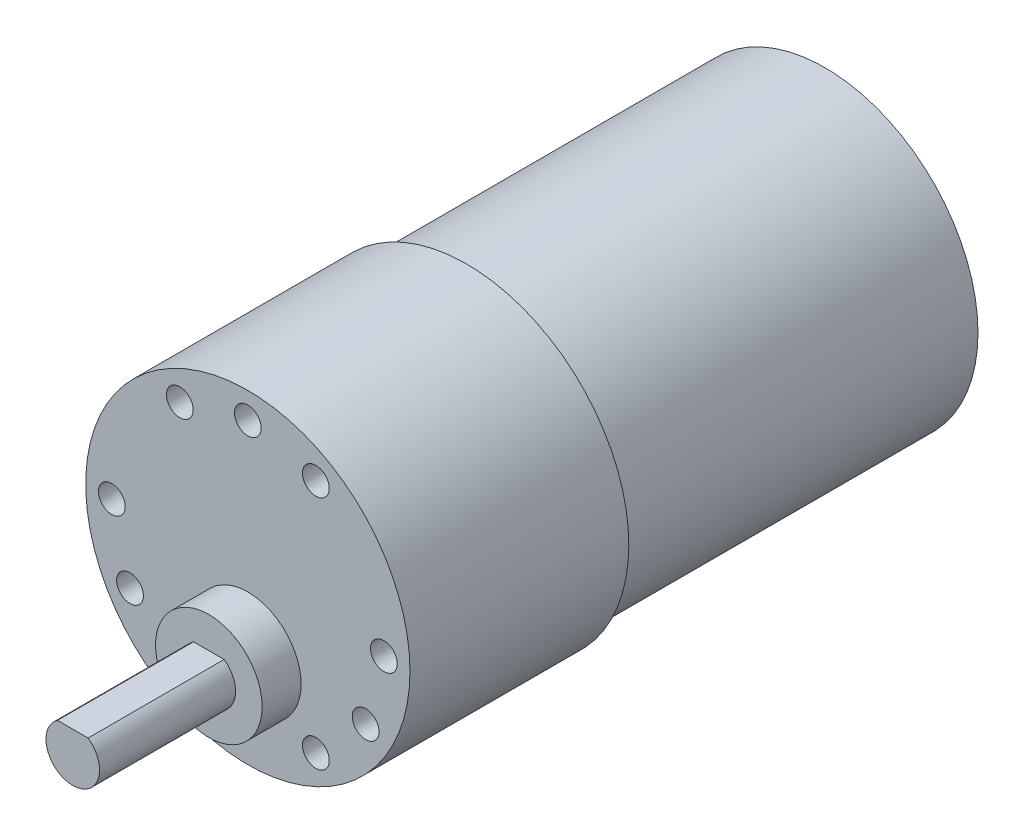
ISO-10303-21;
HEADER;
FILE_DESCRIPTION(('STEP AP214'),'2;1');
FILE_NAME('part.step','',(''),(''),'','','');
FILE_SCHEMA(('AUTOMOTIVE_DESIGN { 1 0 10303 214 1 1 1 1 }'));
ENDSEC;
DATA;
#1=APPLICATION_CONTEXT('core data for automotive mechanical design processes');
#2=APPLICATION_PROTOCOL_DEFINITION('international standard','automotive_design',2000,#1);
#3=PRODUCT_CONTEXT('',#1,'mechanical');
#4=PRODUCT('Part','Part','',(#3));
#5=PRODUCT_RELATED_PRODUCT_CATEGORY('part','',(#4));
#6=PRODUCT_DEFINITION_FORMATION('','',#4);
#7=PRODUCT_DEFINITION_CONTEXT('part definition',#1,'design');
#8=PRODUCT_DEFINITION('design','',#6,#7);
#9=PRODUCT_DEFINITION_SHAPE('','',#8);
#10=(LENGTH_UNIT() NAMED_UNIT(*) SI_UNIT(.MILLI.,.METRE.));
#11=(NAMED_UNIT(*) PLANE_ANGLE_UNIT() SI_UNIT($,.RADIAN.));
#12=(NAMED_UNIT(*) SI_UNIT($,.STERADIAN.) SOLID_ANGLE_UNIT());
#13=UNCERTAINTY_MEASURE_WITH_UNIT(LENGTH_MEASURE(1.E-05),#10,'distance_accuracy_value','');
#14=(GEOMETRIC_REPRESENTATION_CONTEXT(3) GLOBAL_UNCERTAINTY_ASSIGNED_CONTEXT((#13)) GLOBAL_UNIT_ASSIGNED_CONTEXT((#10,
#11,#12)) REPRESENTATION_CONTEXT('',''));
#15=CARTESIAN_POINT('',(0.,0.,0.));
#16=DIRECTION('',(0.,0.,1.));
#17=DIRECTION('',(1.,0.,0.));
#18=AXIS2_PLACEMENT_3D('',#15,#16,#17);
#19=CARTESIAN_POINT('',(0.,0.,-39.116));
#20=DIRECTION('',(0.,0.,-1.));
#21=DIRECTION('',(-1.,0.,0.));
#22=AXIS2_PLACEMENT_3D('',#19,#20,#21);
#23=PLANE('',#22);
#24=DIRECTION('',(0.642787609686543,-0.766044443118975,0.));
#25=VECTOR('',#24,1.);
#26=CARTESIAN_POINT('',(7.15248709016497,-8.91915603771026,-39.116));
#27=LINE('',#26,#25);
#28=CARTESIAN_POINT('',(5.51980656156115,-6.97340315218807,-39.116));
#29=VERTEX_POINT('',#28);
#30=CARTESIAN_POINT('',(7.15248709016497,-8.91915603771026,-39.116));
#31=VERTEX_POINT('',#30);
#32=EDGE_CURVE('E63',#29,#31,#27,.T.);
#33=ORIENTED_EDGE('',*,*,#32,.T.);
#34=DIRECTION('',(-0.766044443118975,-0.642787609686543,0.));
#35=VECTOR('',#34,1.);
#36=CARTESIAN_POINT('',(7.54163766726941,-8.5926199319895,-39.116));
#37=LINE('',#36,#35);
#38=CARTESIAN_POINT('',(7.54163766726941,-8.5926199319895,-39.116));
#39=VERTEX_POINT('',#38);
#40=EDGE_CURVE('E204',#39,#31,#37,.T.);
#41=ORIENTED_EDGE('',*,*,#40,.F.);
#42=DIRECTION('',(0.642787609686543,-0.766044443118975,0.));
#43=VECTOR('',#42,1.);
#44=CARTESIAN_POINT('',(7.54163766726941,-8.5926199319895,-39.116));
#45=LINE('',#44,#43);
#46=CARTESIAN_POINT('',(5.90895713866559,-6.6468670464673,-39.116));
#47=VERTEX_POINT('',#46);
#48=EDGE_CURVE('E179',#47,#39,#45,.T.);
#49=ORIENTED_EDGE('',*,*,#48,.F.);
#50=DIRECTION('',(-0.766044443118975,-0.642787609686543,0.));
#51=VECTOR('',#50,1.);
#52=CARTESIAN_POINT('',(5.90895713866559,-6.6468670464673,-39.116));
#53=LINE('',#52,#51);
#54=EDGE_CURVE('E189',#47,#29,#53,.T.);
#55=ORIENTED_EDGE('',*,*,#54,.T.);
#56=EDGE_LOOP('',(#33,#41,#49,#55));
#57=FACE_BOUND('',#56,.T.);
#58=CARTESIAN_POINT('',(0.,0.,-39.116));
#59=DIRECTION('',(0.,0.,-1.));
#60=DIRECTION('',(-1.,0.,0.));
#61=AXIS2_PLACEMENT_3D('',#58,#59,#60);
#62=CIRCLE('',#61,16.637);
#63=CARTESIAN_POINT('',(-16.637,0.,-39.116));
#64=VERTEX_POINT('',#63);
#65=EDGE_CURVE('E12',#64,#64,#62,.T.);
#66=ORIENTED_EDGE('',*,*,#65,.T.);
#67=EDGE_LOOP('',(#66));
#68=FACE_BOUND('',#67,.T.);
#69=DIRECTION('',(-0.258819045102518,-0.965925826289069,0.));
#70=VECTOR('',#69,1.);
#71=CARTESIAN_POINT('',(-2.87494665811901,-9.7480663576409,-39.116));
#72=LINE('',#71,#70);
#73=CARTESIAN_POINT('',(-2.87494665811901,-9.7480663576409,-39.116));
#74=VERTEX_POINT('',#73);
#75=CARTESIAN_POINT('',(-3.5323470326794,-12.2015179564151,-39.116));
#76=VERTEX_POINT('',#75);
#77=EDGE_CURVE('E55',#74,#76,#72,.T.);
#78=ORIENTED_EDGE('',*,*,#77,.T.);
#79=DIRECTION('',(-0.965925826289069,0.258819045102518,0.));
#80=VECTOR('',#79,1.);
#81=CARTESIAN_POINT('',(-3.04165671292456,-12.3329980313272,-39.116));
#82=LINE('',#81,#80);
#83=CARTESIAN_POINT('',(-3.04165671292456,-12.3329980313272,-39.116));
#84=VERTEX_POINT('',#83);
#85=EDGE_CURVE('E150',#84,#76,#82,.T.);
#86=ORIENTED_EDGE('',*,*,#85,.F.);
#87=DIRECTION('',(-0.258819045102518,-0.965925826289069,0.));
#88=VECTOR('',#87,1.);
#89=CARTESIAN_POINT('',(-2.38425633836416,-9.87954643255298,-39.116));
#90=LINE('',#89,#88);
#91=CARTESIAN_POINT('',(-2.38425633836416,-9.87954643255298,-39.116));
#92=VERTEX_POINT('',#91);
#93=EDGE_CURVE('E156',#92,#84,#90,.T.);
#94=ORIENTED_EDGE('',*,*,#93,.F.);
#95=DIRECTION('',(-0.965925826289069,0.258819045102518,0.));
#96=VECTOR('',#95,1.);
#97=CARTESIAN_POINT('',(-2.38425633836416,-9.87954643255298,-39.116));
#98=LINE('',#97,#96);
#99=EDGE_CURVE('E521',#92,#74,#98,.T.);
#100=ORIENTED_EDGE('',*,*,#99,.T.);
#101=EDGE_LOOP('',(#78,#86,#94,#100));
#102=FACE_BOUND('',#101,.T.);
#103=ADVANCED_FACE('F41',(#57,#68,#102),#23,.T.);
#104=CARTESIAN_POINT('',(0.,0.,-40.132));
#105=DIRECTION('',(0.,0.,-1.));
#106=DIRECTION('',(-1.,0.,0.));
#107=AXIS2_PLACEMENT_3D('',#104,#105,#106);
#108=PLANE('',#107);
#109=CARTESIAN_POINT('',(0.,0.,-40.132));
#110=DIRECTION('',(0.,0.,-1.));
#111=DIRECTION('',(-1.,0.,0.));
#112=AXIS2_PLACEMENT_3D('',#109,#110,#111);
#113=CIRCLE('',#112,16.637);
#114=CARTESIAN_POINT('',(-16.637,0.,-40.132));
#115=VERTEX_POINT('',#114);
#116=EDGE_CURVE('E48',#115,#115,#113,.T.);
#117=ORIENTED_EDGE('',*,*,#116,.F.);
#118=EDGE_LOOP('',(#117));
#119=FACE_BOUND('',#118,.T.);
#120=CARTESIAN_POINT('',(0.,0.,-40.132));
#121=DIRECTION('',(0.,0.,-1.));
#122=DIRECTION('',(-1.,0.,0.));
#123=AXIS2_PLACEMENT_3D('',#120,#121,#122);
#124=CIRCLE('',#123,17.145);
#125=CARTESIAN_POINT('',(-17.145,0.,-40.132));
#126=VERTEX_POINT('',#125);
#127=EDGE_CURVE('E207',#126,#126,#124,.T.);
#128=ORIENTED_EDGE('',*,*,#127,.T.);
#129=EDGE_LOOP('',(#128));
#130=FACE_BOUND('',#129,.T.);
#131=ADVANCED_FACE('F298',(#119,#130),#108,.T.);
#132=CARTESIAN_POINT('',(0.,0.,0.));
#133=DIRECTION('',(0.,0.,1.));
#134=DIRECTION('',(1.,0.,0.));
#135=AXIS2_PLACEMENT_3D('',#132,#133,#134);
#136=PLANE('',#135);
#137=CARTESIAN_POINT('',(0.,0.,0.));
#138=DIRECTION('',(0.,0.,1.));
#139=DIRECTION('',(1.,0.,0.));
#140=AXIS2_PLACEMENT_3D('',#137,#138,#139);
#141=CIRCLE('',#140,18.161);
#142=CARTESIAN_POINT('',(18.161,0.,0.));
#143=VERTEX_POINT('',#142);
#144=EDGE_CURVE('E212',#143,#143,#141,.T.);
#145=ORIENTED_EDGE('',*,*,#144,.F.);
#146=EDGE_LOOP('',(#145));
#147=FACE_BOUND('',#146,.T.);
#148=CARTESIAN_POINT('',(0.,0.,0.));
#149=DIRECTION('',(0.,0.,1.));
#150=DIRECTION('',(1.,0.,0.));
#151=AXIS2_PLACEMENT_3D('',#148,#149,#150);
#152=CIRCLE('',#151,17.145);
#153=CARTESIAN_POINT('',(17.145,0.,0.));
#154=VERTEX_POINT('',#153);
#155=EDGE_CURVE('E208',#154,#154,#152,.F.);
#156=ORIENTED_EDGE('',*,*,#155,.F.);
#157=EDGE_LOOP('',(#156));
#158=FACE_BOUND('',#157,.T.);
#159=ADVANCED_FACE('F301',(#147,#158),#136,.F.);
#160=CARTESIAN_POINT('',(0.,-7.366,28.8798));
#161=DIRECTION('',(0.,0.,1.));
#162=DIRECTION('',(1.,0.,0.));
#163=AXIS2_PLACEMENT_3D('',#160,#161,#162);
#164=PLANE('',#163);
#165=CARTESIAN_POINT('',(0.,-7.366,28.8798));
#166=DIRECTION('',(0.,0.,1.));
#167=DIRECTION('',(1.,0.,0.));
#168=AXIS2_PLACEMENT_3D('',#165,#166,#167);
#169=CIRCLE('',#168,5.969);
#170=CARTESIAN_POINT('',(5.969,-7.366,28.8798));
#171=VERTEX_POINT('',#170);
#172=EDGE_CURVE('E219',#171,#171,#169,.T.);
#173=ORIENTED_EDGE('',*,*,#172,.T.);
#174=EDGE_LOOP('',(#173));
#175=FACE_BOUND('',#174,.T.);
#176=DIRECTION('',(-1.,0.,0.));
#177=VECTOR('',#176,1.);
#178=CARTESIAN_POINT('',(-1.71565701700544,-4.905,28.8798));
#179=LINE('',#178,#177);
#180=CARTESIAN_POINT('',(1.71565701700544,-4.905,28.8798));
#181=VERTEX_POINT('',#180);
#182=CARTESIAN_POINT('',(-1.71565701700544,-4.905,28.8798));
#183=VERTEX_POINT('',#182);
#184=EDGE_CURVE('E229',#181,#183,#179,.T.);
#185=ORIENTED_EDGE('',*,*,#184,.F.);
#186=CARTESIAN_POINT('',(0.,-7.366,28.8798));
#187=DIRECTION('',(0.,0.,1.));
#188=DIRECTION('',(1.,0.,0.));
#189=AXIS2_PLACEMENT_3D('',#186,#187,#188);
#190=CIRCLE('',#189,3.);
#191=EDGE_CURVE('E222',#183,#181,#190,.T.);
#192=ORIENTED_EDGE('',*,*,#191,.F.);
#193=EDGE_LOOP('',(#185,#192));
#194=FACE_BOUND('',#193,.T.);
#195=ADVANCED_FACE('F313',(#175,#194),#164,.T.);
#196=CARTESIAN_POINT('',(0.,0.,24.511));
#197=DIRECTION('',(0.,0.,1.));
#198=DIRECTION('',(1.,0.,0.));
#199=AXIS2_PLACEMENT_3D('',#196,#197,#198);
#200=PLANE('',#199);
#201=CARTESIAN_POINT('',(-7.61999999999983,13.1982271536749,24.511));
#202=DIRECTION('',(0.,0.,1.));
#203=DIRECTION('',(1.,0.,0.));
#204=AXIS2_PLACEMENT_3D('',#201,#202,#203);
#205=CIRCLE('',#204,1.49999999999999);
#206=CARTESIAN_POINT('',(-6.11999999999984,13.1982271536749,24.511));
#207=VERTEX_POINT('',#206);
#208=EDGE_CURVE('E211',#207,#207,#205,.T.);
#209=ORIENTED_EDGE('',*,*,#208,.F.);
#210=EDGE_LOOP('',(#209));
#211=FACE_BOUND('',#210,.T.);
#212=CARTESIAN_POINT('',(-15.24,1.59630526811908E-13,24.511));
#213=DIRECTION('',(0.,0.,1.));
#214=DIRECTION('',(1.,0.,0.));
#215=AXIS2_PLACEMENT_3D('',#212,#213,#214);
#216=CIRCLE('',#215,1.49999999999999);
#217=CARTESIAN_POINT('',(-13.74,1.59630526811908E-13,24.511));
#218=VERTEX_POINT('',#217);
#219=EDGE_CURVE('E284',#218,#218,#216,.T.);
#220=ORIENTED_EDGE('',*,*,#219,.F.);
#221=EDGE_LOOP('',(#220));
#222=FACE_BOUND('',#221,.T.);
#223=CARTESIAN_POINT('',(-13.1982271536749,-7.61999999999988,24.511));
#224=DIRECTION('',(0.,0.,1.));
#225=DIRECTION('',(1.,0.,0.));
#226=AXIS2_PLACEMENT_3D('',#223,#224,#225);
#227=CIRCLE('',#226,1.49999999999999);
#228=CARTESIAN_POINT('',(-11.6982271536749,-7.61999999999988,24.511));
#229=VERTEX_POINT('',#228);
#230=EDGE_CURVE('E278',#229,#229,#227,.T.);
#231=ORIENTED_EDGE('',*,*,#230,.F.);
#232=EDGE_LOOP('',(#231));
#233=FACE_BOUND('',#232,.T.);
#234=CARTESIAN_POINT('',(-7.62000000000011,-13.1982271536748,24.511));
#235=DIRECTION('',(0.,0.,1.));
#236=DIRECTION('',(1.,0.,0.));
#237=AXIS2_PLACEMENT_3D('',#234,#235,#236);
#238=CIRCLE('',#237,1.49999999999999);
#239=CARTESIAN_POINT('',(-6.12000000000012,-13.1982271536748,24.511));
#240=VERTEX_POINT('',#239);
#241=EDGE_CURVE('E272',#240,#240,#238,.T.);
#242=ORIENTED_EDGE('',*,*,#241,.F.);
#243=EDGE_LOOP('',(#242));
#244=FACE_BOUND('',#243,.T.);
#245=CARTESIAN_POINT('',(7.61999999999992,-13.1982271536749,24.511));
#246=DIRECTION('',(0.,0.,1.));
#247=DIRECTION('',(1.,0.,0.));
#248=AXIS2_PLACEMENT_3D('',#245,#246,#247);
#249=CIRCLE('',#248,1.49999999999999);
#250=CARTESIAN_POINT('',(9.11999999999991,-13.1982271536749,24.511));
#251=VERTEX_POINT('',#250);
#252=EDGE_CURVE('E266',#251,#251,#249,.T.);
#253=ORIENTED_EDGE('',*,*,#252,.F.);
#254=EDGE_LOOP('',(#253));
#255=FACE_BOUND('',#254,.T.);
#256=CARTESIAN_POINT('',(13.1982271536748,-7.62000000000006,24.511));
#257=DIRECTION('',(0.,0.,1.));
#258=DIRECTION('',(1.,0.,0.));
#259=AXIS2_PLACEMENT_3D('',#256,#257,#258);
#260=CIRCLE('',#259,1.49999999999999);
#261=CARTESIAN_POINT('',(14.6982271536748,-7.62000000000006,24.511));
#262=VERTEX_POINT('',#261);
#263=EDGE_CURVE('E260',#262,#262,#260,.T.);
#264=ORIENTED_EDGE('',*,*,#263,.F.);
#265=EDGE_LOOP('',(#264));
#266=FACE_BOUND('',#265,.T.);
#267=CARTESIAN_POINT('',(15.24,0.,24.511));
#268=DIRECTION('',(0.,0.,1.));
#269=DIRECTION('',(1.,0.,0.));
#270=AXIS2_PLACEMENT_3D('',#267,#268,#269);
#271=CIRCLE('',#270,1.49999999999999);
#272=CARTESIAN_POINT('',(16.74,0.,24.511));
#273=VERTEX_POINT('',#272);
#274=EDGE_CURVE('E254',#273,#273,#271,.T.);
#275=ORIENTED_EDGE('',*,*,#274,.F.);
#276=EDGE_LOOP('',(#275));
#277=FACE_BOUND('',#276,.T.);
#278=CARTESIAN_POINT('',(7.62000000000002,13.1982271536748,24.511));
#279=DIRECTION('',(0.,0.,1.));
#280=DIRECTION('',(1.,0.,0.));
#281=AXIS2_PLACEMENT_3D('',#278,#279,#280);
#282=CIRCLE('',#281,1.49999999999999);
#283=CARTESIAN_POINT('',(9.12,13.1982271536748,24.511));
#284=VERTEX_POINT('',#283);
#285=EDGE_CURVE('E248',#284,#284,#282,.T.);
#286=ORIENTED_EDGE('',*,*,#285,.F.);
#287=EDGE_LOOP('',(#286));
#288=FACE_BOUND('',#287,.T.);
#289=CARTESIAN_POINT('',(0.,15.24,24.511));
#290=DIRECTION('',(0.,0.,1.));
#291=DIRECTION('',(1.,0.,0.));
#292=AXIS2_PLACEMENT_3D('',#289,#290,#291);
#293=CIRCLE('',#292,1.49999999999999);
#294=CARTESIAN_POINT('',(1.49999999999999,15.24,24.511));
#295=VERTEX_POINT('',#294);
#296=EDGE_CURVE('E242',#295,#295,#293,.T.);
#297=ORIENTED_EDGE('',*,*,#296,.F.);
#298=EDGE_LOOP('',(#297));
#299=FACE_BOUND('',#298,.T.);
#300=CARTESIAN_POINT('',(0.,0.,24.511));
#301=DIRECTION('',(0.,0.,1.));
#302=DIRECTION('',(1.,0.,0.));
#303=AXIS2_PLACEMENT_3D('',#300,#301,#302);
#304=CIRCLE('',#303,18.161);
#305=CARTESIAN_POINT('',(18.161,0.,24.511));
#306=VERTEX_POINT('',#305);
#307=EDGE_CURVE('E216',#306,#306,#304,.T.);
#308=ORIENTED_EDGE('',*,*,#307,.T.);
#309=EDGE_LOOP('',(#308));
#310=FACE_BOUND('',#309,.T.);
#311=CARTESIAN_POINT('',(0.,-7.366,24.511));
#312=DIRECTION('',(0.,0.,1.));
#313=DIRECTION('',(1.,0.,0.));
#314=AXIS2_PLACEMENT_3D('',#311,#312,#313);
#315=CIRCLE('',#314,5.969);
#316=CARTESIAN_POINT('',(5.969,-7.366,24.511));
#317=VERTEX_POINT('',#316);
#318=EDGE_CURVE('E215',#317,#317,#315,.T.);
#319=ORIENTED_EDGE('',*,*,#318,.F.);
#320=EDGE_LOOP('',(#319));
#321=FACE_BOUND('',#320,.T.);
#322=ADVANCED_FACE('F319',(#211,#222,#233,#244,#255,#266,#277,#288,#299,#310,#321),#200,.T.);
#323=CARTESIAN_POINT('',(0.,0.,24.511));
#324=DIRECTION('',(0.,0.,-1.));
#325=DIRECTION('',(-1.,0.,0.));
#326=AXIS2_PLACEMENT_3D('',#323,#324,#325);
#327=CYLINDRICAL_SURFACE('',#326,18.161);
#328=ORIENTED_EDGE('',*,*,#307,.F.);
#329=EDGE_LOOP('',(#328));
#330=FACE_BOUND('',#329,.T.);
#331=ORIENTED_EDGE('',*,*,#144,.T.);
#332=EDGE_LOOP('',(#331));
#333=FACE_BOUND('',#332,.T.);
#334=ADVANCED_FACE('F427',(#330,#333),#327,.T.);
#335=CARTESIAN_POINT('',(0.,-7.366,28.8798));
#336=DIRECTION('',(0.,0.,-1.));
#337=DIRECTION('',(-1.,0.,0.));
#338=AXIS2_PLACEMENT_3D('',#335,#336,#337);
#339=CYLINDRICAL_SURFACE('',#338,5.969);
#340=ORIENTED_EDGE('',*,*,#172,.F.);
#341=EDGE_LOOP('',(#340));
#342=FACE_BOUND('',#341,.T.);
#343=ORIENTED_EDGE('',*,*,#318,.T.);
#344=EDGE_LOOP('',(#343));
#345=FACE_BOUND('',#344,.T.);
#346=ADVANCED_FACE('F423',(#342,#345),#339,.T.);
#347=CARTESIAN_POINT('',(0.,-7.366,44.1198));
#348=DIRECTION('',(0.,0.,-1.));
#349=DIRECTION('',(-1.,0.,0.));
#350=AXIS2_PLACEMENT_3D('',#347,#348,#349);
#351=CYLINDRICAL_SURFACE('',#350,3.);
#352=ORIENTED_EDGE('',*,*,#191,.T.);
#353=DIRECTION('',(0.,0.,-1.));
#354=VECTOR('',#353,1.);
#355=CARTESIAN_POINT('',(1.71565701700544,-4.905,44.1198));
#356=LINE('',#355,#354);
#357=CARTESIAN_POINT('',(1.71565701700544,-4.905,44.1198));
#358=VERTEX_POINT('',#357);
#359=EDGE_CURVE('E225',#358,#181,#356,.T.);
#360=ORIENTED_EDGE('',*,*,#359,.F.);
#361=CARTESIAN_POINT('',(0.,-7.366,44.1198));
#362=DIRECTION('',(0.,0.,1.));
#363=DIRECTION('',(1.,0.,0.));
#364=AXIS2_PLACEMENT_3D('',#361,#362,#363);
#365=CIRCLE('',#364,3.);
#366=CARTESIAN_POINT('',(-1.71565701700544,-4.905,44.1198));
#367=VERTEX_POINT('',#366);
#368=EDGE_CURVE('E228',#367,#358,#365,.T.);
#369=ORIENTED_EDGE('',*,*,#368,.F.);
#370=DIRECTION('',(0.,0.,-1.));
#371=VECTOR('',#370,1.);
#372=CARTESIAN_POINT('',(-1.71565701700544,-4.905,44.1198));
#373=LINE('',#372,#371);
#374=EDGE_CURVE('E230',#367,#183,#373,.T.);
#375=ORIENTED_EDGE('',*,*,#374,.T.);
#376=EDGE_LOOP('',(#352,#360,#369,#375));
#377=FACE_BOUND('',#376,.T.);
#378=ADVANCED_FACE('F420',(#377),#351,.T.);
#379=CARTESIAN_POINT('',(-1.71565701700544,-4.905,44.1198));
#380=DIRECTION('',(0.,-1.,0.));
#381=DIRECTION('',(0.,0.,-1.));
#382=AXIS2_PLACEMENT_3D('',#379,#380,#381);
#383=PLANE('',#382);
#384=ORIENTED_EDGE('',*,*,#184,.T.);
#385=ORIENTED_EDGE('',*,*,#374,.F.);
#386=DIRECTION('',(-1.,0.,0.));
#387=VECTOR('',#386,1.);
#388=CARTESIAN_POINT('',(-1.71565701700544,-4.905,44.1198));
#389=LINE('',#388,#387);
#390=EDGE_CURVE('E235',#358,#367,#389,.T.);
#391=ORIENTED_EDGE('',*,*,#390,.F.);
#392=ORIENTED_EDGE('',*,*,#359,.T.);
#393=EDGE_LOOP('',(#384,#385,#391,#392));
#394=FACE_BOUND('',#393,.T.);
#395=ADVANCED_FACE('F416',(#394),#383,.F.);
#396=CARTESIAN_POINT('',(0.,-7.366,44.1198));
#397=DIRECTION('',(0.,0.,1.));
#398=DIRECTION('',(1.,0.,0.));
#399=AXIS2_PLACEMENT_3D('',#396,#397,#398);
#400=PLANE('',#399);
#401=ORIENTED_EDGE('',*,*,#368,.T.);
#402=ORIENTED_EDGE('',*,*,#390,.T.);
#403=EDGE_LOOP('',(#401,#402));
#404=FACE_BOUND('',#403,.T.);
#405=ADVANCED_FACE('F412',(#404),#400,.T.);
#406=CARTESIAN_POINT('',(0.,15.24,14.351));
#407=DIRECTION('',(0.,0.,1.));
#408=DIRECTION('',(1.,0.,0.));
#409=AXIS2_PLACEMENT_3D('',#406,#407,#408);
#410=CONICAL_SURFACE('',#409,1.49999999999999,1.02974425867665);
#411=CARTESIAN_POINT('',(0.,15.24,13.4497090714587));
#412=VERTEX_POINT('',#411);
#413=VERTEX_LOOP('',#412);
#414=FACE_BOUND('',#413,.T.);
#415=CARTESIAN_POINT('',(0.,15.24,14.351));
#416=DIRECTION('',(0.,0.,1.));
#417=DIRECTION('',(1.,0.,0.));
#418=AXIS2_PLACEMENT_3D('',#415,#416,#417);
#419=CIRCLE('',#418,1.49999999999999);
#420=CARTESIAN_POINT('',(1.49999999999999,15.24,14.351));
#421=VERTEX_POINT('',#420);
#422=EDGE_CURVE('E237',#421,#421,#419,.T.);
#423=ORIENTED_EDGE('',*,*,#422,.T.);
#424=EDGE_LOOP('',(#423));
#425=FACE_BOUND('',#424,.T.);
#426=ADVANCED_FACE('F408',(#414,#425),#410,.F.);
#427=CARTESIAN_POINT('',(0.,15.24,24.511));
#428=DIRECTION('',(0.,0.,1.));
#429=DIRECTION('',(1.,0.,0.));
#430=AXIS2_PLACEMENT_3D('',#427,#428,#429);
#431=CYLINDRICAL_SURFACE('',#430,1.49999999999999);
#432=ORIENTED_EDGE('',*,*,#422,.F.);
#433=EDGE_LOOP('',(#432));
#434=FACE_BOUND('',#433,.T.);
#435=ORIENTED_EDGE('',*,*,#296,.T.);
#436=EDGE_LOOP('',(#435));
#437=FACE_BOUND('',#436,.T.);
#438=ADVANCED_FACE('F404',(#434,#437),#431,.F.);
#439=CARTESIAN_POINT('',(7.62000000000002,13.1982271536748,14.351));
#440=DIRECTION('',(0.,0.,1.));
#441=DIRECTION('',(1.,0.,0.));
#442=AXIS2_PLACEMENT_3D('',#439,#440,#441);
#443=CONICAL_SURFACE('',#442,1.49999999999999,1.02974425867665);
#444=CARTESIAN_POINT('',(7.62000000000001,13.1982271536748,13.4497090714587));
#445=VERTEX_POINT('',#444);
#446=VERTEX_LOOP('',#445);
#447=FACE_BOUND('',#446,.T.);
#448=CARTESIAN_POINT('',(7.62000000000002,13.1982271536748,14.351));
#449=DIRECTION('',(0.,0.,1.));
#450=DIRECTION('',(1.,0.,0.));
#451=AXIS2_PLACEMENT_3D('',#448,#449,#450);
#452=CIRCLE('',#451,1.49999999999999);
#453=CARTESIAN_POINT('',(9.12,13.1982271536748,14.351));
#454=VERTEX_POINT('',#453);
#455=EDGE_CURVE('E245',#454,#454,#452,.T.);
#456=ORIENTED_EDGE('',*,*,#455,.T.);
#457=EDGE_LOOP('',(#456));
#458=FACE_BOUND('',#457,.T.);
#459=ADVANCED_FACE('F400',(#447,#458),#443,.F.);
#460=CARTESIAN_POINT('',(7.62000000000002,13.1982271536748,24.511));
#461=DIRECTION('',(0.,0.,1.));
#462=DIRECTION('',(1.,0.,0.));
#463=AXIS2_PLACEMENT_3D('',#460,#461,#462);
#464=CYLINDRICAL_SURFACE('',#463,1.49999999999999);
#465=ORIENTED_EDGE('',*,*,#455,.F.);
#466=EDGE_LOOP('',(#465));
#467=FACE_BOUND('',#466,.T.);
#468=ORIENTED_EDGE('',*,*,#285,.T.);
#469=EDGE_LOOP('',(#468));
#470=FACE_BOUND('',#469,.T.);
#471=ADVANCED_FACE('F396',(#467,#470),#464,.F.);
#472=CARTESIAN_POINT('',(15.24,0.,14.351));
#473=DIRECTION('',(0.,0.,1.));
#474=DIRECTION('',(1.,0.,0.));
#475=AXIS2_PLACEMENT_3D('',#472,#473,#474);
#476=CONICAL_SURFACE('',#475,1.49999999999999,1.02974425867665);
#477=CARTESIAN_POINT('',(15.24,0.,13.4497090714587));
#478=VERTEX_POINT('',#477);
#479=VERTEX_LOOP('',#478);
#480=FACE_BOUND('',#479,.T.);
#481=CARTESIAN_POINT('',(15.24,0.,14.351));
#482=DIRECTION('',(0.,0.,1.));
#483=DIRECTION('',(1.,0.,0.));
#484=AXIS2_PLACEMENT_3D('',#481,#482,#483);
#485=CIRCLE('',#484,1.49999999999999);
#486=CARTESIAN_POINT('',(16.74,0.,14.351));
#487=VERTEX_POINT('',#486);
#488=EDGE_CURVE('E251',#487,#487,#485,.T.);
#489=ORIENTED_EDGE('',*,*,#488,.T.);
#490=EDGE_LOOP('',(#489));
#491=FACE_BOUND('',#490,.T.);
#492=ADVANCED_FACE('F392',(#480,#491),#476,.F.);
#493=CARTESIAN_POINT('',(15.24,0.,24.511));
#494=DIRECTION('',(0.,0.,1.));
#495=DIRECTION('',(1.,0.,0.));
#496=AXIS2_PLACEMENT_3D('',#493,#494,#495);
#497=CYLINDRICAL_SURFACE('',#496,1.49999999999999);
#498=ORIENTED_EDGE('',*,*,#488,.F.);
#499=EDGE_LOOP('',(#498));
#500=FACE_BOUND('',#499,.T.);
#501=ORIENTED_EDGE('',*,*,#274,.T.);
#502=EDGE_LOOP('',(#501));
#503=FACE_BOUND('',#502,.T.);
#504=ADVANCED_FACE('F388',(#500,#503),#497,.F.);
#505=CARTESIAN_POINT('',(13.1982271536748,-7.62000000000006,14.351));
#506=DIRECTION('',(0.,0.,1.));
#507=DIRECTION('',(1.,0.,0.));
#508=AXIS2_PLACEMENT_3D('',#505,#506,#507);
#509=CONICAL_SURFACE('',#508,1.49999999999999,1.02974425867665);
#510=CARTESIAN_POINT('',(13.1982271536748,-7.62000000000006,13.4497090714587));
#511=VERTEX_POINT('',#510);
#512=VERTEX_LOOP('',#511);
#513=FACE_BOUND('',#512,.T.);
#514=CARTESIAN_POINT('',(13.1982271536748,-7.62000000000006,14.351));
#515=DIRECTION('',(0.,0.,1.));
#516=DIRECTION('',(1.,0.,0.));
#517=AXIS2_PLACEMENT_3D('',#514,#515,#516);
#518=CIRCLE('',#517,1.49999999999999);
#519=CARTESIAN_POINT('',(14.6982271536748,-7.62000000000006,14.351));
#520=VERTEX_POINT('',#519);
#521=EDGE_CURVE('E257',#520,#520,#518,.T.);
#522=ORIENTED_EDGE('',*,*,#521,.T.);
#523=EDGE_LOOP('',(#522));
#524=FACE_BOUND('',#523,.T.);
#525=ADVANCED_FACE('F384',(#513,#524),#509,.F.);
#526=CARTESIAN_POINT('',(13.1982271536748,-7.62000000000006,24.511));
#527=DIRECTION('',(0.,0.,1.));
#528=DIRECTION('',(1.,0.,0.));
#529=AXIS2_PLACEMENT_3D('',#526,#527,#528);
#530=CYLINDRICAL_SURFACE('',#529,1.49999999999999);
#531=ORIENTED_EDGE('',*,*,#521,.F.);
#532=EDGE_LOOP('',(#531));
#533=FACE_BOUND('',#532,.T.);
#534=ORIENTED_EDGE('',*,*,#263,.T.);
#535=EDGE_LOOP('',(#534));
#536=FACE_BOUND('',#535,.T.);
#537=ADVANCED_FACE('F380',(#533,#536),#530,.F.);
#538=CARTESIAN_POINT('',(7.61999999999992,-13.1982271536749,14.351));
#539=DIRECTION('',(0.,0.,1.));
#540=DIRECTION('',(1.,0.,0.));
#541=AXIS2_PLACEMENT_3D('',#538,#539,#540);
#542=CONICAL_SURFACE('',#541,1.49999999999999,1.02974425867665);
#543=CARTESIAN_POINT('',(7.61999999999992,-13.1982271536749,13.4497090714587));
#544=VERTEX_POINT('',#543);
#545=VERTEX_LOOP('',#544);
#546=FACE_BOUND('',#545,.T.);
#547=CARTESIAN_POINT('',(7.61999999999992,-13.1982271536749,14.351));
#548=DIRECTION('',(0.,0.,1.));
#549=DIRECTION('',(1.,0.,0.));
#550=AXIS2_PLACEMENT_3D('',#547,#548,#549);
#551=CIRCLE('',#550,1.49999999999999);
#552=CARTESIAN_POINT('',(9.11999999999991,-13.1982271536749,14.351));
#553=VERTEX_POINT('',#552);
#554=EDGE_CURVE('E263',#553,#553,#551,.T.);
#555=ORIENTED_EDGE('',*,*,#554,.T.);
#556=EDGE_LOOP('',(#555));
#557=FACE_BOUND('',#556,.T.);
#558=ADVANCED_FACE('F376',(#546,#557),#542,.F.);
#559=CARTESIAN_POINT('',(7.61999999999992,-13.1982271536749,24.511));
#560=DIRECTION('',(0.,0.,1.));
#561=DIRECTION('',(1.,0.,0.));
#562=AXIS2_PLACEMENT_3D('',#559,#560,#561);
#563=CYLINDRICAL_SURFACE('',#562,1.49999999999999);
#564=ORIENTED_EDGE('',*,*,#554,.F.);
#565=EDGE_LOOP('',(#564));
#566=FACE_BOUND('',#565,.T.);
#567=ORIENTED_EDGE('',*,*,#252,.T.);
#568=EDGE_LOOP('',(#567));
#569=FACE_BOUND('',#568,.T.);
#570=ADVANCED_FACE('F372',(#566,#569),#563,.F.);
#571=CARTESIAN_POINT('',(-7.62000000000011,-13.1982271536748,14.351));
#572=DIRECTION('',(0.,0.,1.));
#573=DIRECTION('',(1.,0.,0.));
#574=AXIS2_PLACEMENT_3D('',#571,#572,#573);
#575=CONICAL_SURFACE('',#574,1.49999999999999,1.02974425867665);
#576=CARTESIAN_POINT('',(-7.62000000000011,-13.1982271536748,13.4497090714587));
#577=VERTEX_POINT('',#576);
#578=VERTEX_LOOP('',#577);
#579=FACE_BOUND('',#578,.T.);
#580=CARTESIAN_POINT('',(-7.62000000000011,-13.1982271536748,14.351));
#581=DIRECTION('',(0.,0.,1.));
#582=DIRECTION('',(1.,0.,0.));
#583=AXIS2_PLACEMENT_3D('',#580,#581,#582);
#584=CIRCLE('',#583,1.49999999999999);
#585=CARTESIAN_POINT('',(-6.12000000000012,-13.1982271536748,14.351));
#586=VERTEX_POINT('',#585);
#587=EDGE_CURVE('E269',#586,#586,#584,.T.);
#588=ORIENTED_EDGE('',*,*,#587,.T.);
#589=EDGE_LOOP('',(#588));
#590=FACE_BOUND('',#589,.T.);
#591=ADVANCED_FACE('F368',(#579,#590),#575,.F.);
#592=CARTESIAN_POINT('',(-7.62000000000011,-13.1982271536748,24.511));
#593=DIRECTION('',(0.,0.,1.));
#594=DIRECTION('',(1.,0.,0.));
#595=AXIS2_PLACEMENT_3D('',#592,#593,#594);
#596=CYLINDRICAL_SURFACE('',#595,1.49999999999999);
#597=ORIENTED_EDGE('',*,*,#587,.F.);
#598=EDGE_LOOP('',(#597));
#599=FACE_BOUND('',#598,.T.);
#600=ORIENTED_EDGE('',*,*,#241,.T.);
#601=EDGE_LOOP('',(#600));
#602=FACE_BOUND('',#601,.T.);
#603=ADVANCED_FACE('F364',(#599,#602),#596,.F.);
#604=CARTESIAN_POINT('',(-13.1982271536749,-7.61999999999988,14.351));
#605=DIRECTION('',(0.,0.,1.));
#606=DIRECTION('',(1.,0.,0.));
#607=AXIS2_PLACEMENT_3D('',#604,#605,#606);
#608=CONICAL_SURFACE('',#607,1.49999999999999,1.02974425867665);
#609=CARTESIAN_POINT('',(-13.1982271536749,-7.61999999999988,13.4497090714587));
#610=VERTEX_POINT('',#609);
#611=VERTEX_LOOP('',#610);
#612=FACE_BOUND('',#611,.T.);
#613=CARTESIAN_POINT('',(-13.1982271536749,-7.61999999999988,14.351));
#614=DIRECTION('',(0.,0.,1.));
#615=DIRECTION('',(1.,0.,0.));
#616=AXIS2_PLACEMENT_3D('',#613,#614,#615);
#617=CIRCLE('',#616,1.49999999999999);
#618=CARTESIAN_POINT('',(-11.6982271536749,-7.61999999999988,14.351));
#619=VERTEX_POINT('',#618);
#620=EDGE_CURVE('E275',#619,#619,#617,.T.);
#621=ORIENTED_EDGE('',*,*,#620,.T.);
#622=EDGE_LOOP('',(#621));
#623=FACE_BOUND('',#622,.T.);
#624=ADVANCED_FACE('F360',(#612,#623),#608,.F.);
#625=CARTESIAN_POINT('',(-13.1982271536749,-7.61999999999988,24.511));
#626=DIRECTION('',(0.,0.,1.));
#627=DIRECTION('',(1.,0.,0.));
#628=AXIS2_PLACEMENT_3D('',#625,#626,#627);
#629=CYLINDRICAL_SURFACE('',#628,1.49999999999999);
#630=ORIENTED_EDGE('',*,*,#620,.F.);
#631=EDGE_LOOP('',(#630));
#632=FACE_BOUND('',#631,.T.);
#633=ORIENTED_EDGE('',*,*,#230,.T.);
#634=EDGE_LOOP('',(#633));
#635=FACE_BOUND('',#634,.T.);
#636=ADVANCED_FACE('F356',(#632,#635),#629,.F.);
#637=CARTESIAN_POINT('',(-15.24,1.59630526811908E-13,14.351));
#638=DIRECTION('',(0.,0.,1.));
#639=DIRECTION('',(1.,0.,0.));
#640=AXIS2_PLACEMENT_3D('',#637,#638,#639);
#641=CONICAL_SURFACE('',#640,1.49999999999999,1.02974425867665);
#642=CARTESIAN_POINT('',(-15.24,1.59630526811908E-13,13.4497090714587));
#643=VERTEX_POINT('',#642);
#644=VERTEX_LOOP('',#643);
#645=FACE_BOUND('',#644,.T.);
#646=CARTESIAN_POINT('',(-15.24,1.59630526811908E-13,14.351));
#647=DIRECTION('',(0.,0.,1.));
#648=DIRECTION('',(1.,0.,0.));
#649=AXIS2_PLACEMENT_3D('',#646,#647,#648);
#650=CIRCLE('',#649,1.49999999999999);
#651=CARTESIAN_POINT('',(-13.74,1.59630526811908E-13,14.351));
#652=VERTEX_POINT('',#651);
#653=EDGE_CURVE('E281',#652,#652,#650,.T.);
#654=ORIENTED_EDGE('',*,*,#653,.T.);
#655=EDGE_LOOP('',(#654));
#656=FACE_BOUND('',#655,.T.);
#657=ADVANCED_FACE('F352',(#645,#656),#641,.F.);
#658=CARTESIAN_POINT('',(-15.24,1.59630526811908E-13,24.511));
#659=DIRECTION('',(0.,0.,1.));
#660=DIRECTION('',(1.,0.,0.));
#661=AXIS2_PLACEMENT_3D('',#658,#659,#660);
#662=CYLINDRICAL_SURFACE('',#661,1.49999999999999);
#663=ORIENTED_EDGE('',*,*,#653,.F.);
#664=EDGE_LOOP('',(#663));
#665=FACE_BOUND('',#664,.T.);
#666=ORIENTED_EDGE('',*,*,#219,.T.);
#667=EDGE_LOOP('',(#666));
#668=FACE_BOUND('',#667,.T.);
#669=ADVANCED_FACE('F348',(#665,#668),#662,.F.);
#670=CARTESIAN_POINT('',(-7.61999999999983,13.1982271536749,14.351));
#671=DIRECTION('',(0.,0.,1.));
#672=DIRECTION('',(1.,0.,0.));
#673=AXIS2_PLACEMENT_3D('',#670,#671,#672);
#674=CONICAL_SURFACE('',#673,1.49999999999999,1.02974425867665);
#675=CARTESIAN_POINT('',(-7.61999999999983,13.1982271536749,13.4497090714587));
#676=VERTEX_POINT('',#675);
#677=VERTEX_LOOP('',#676);
#678=FACE_BOUND('',#677,.T.);
#679=CARTESIAN_POINT('',(-7.61999999999983,13.1982271536749,14.351));
#680=DIRECTION('',(0.,0.,1.));
#681=DIRECTION('',(1.,0.,0.));
#682=AXIS2_PLACEMENT_3D('',#679,#680,#681);
#683=CIRCLE('',#682,1.49999999999999);
#684=CARTESIAN_POINT('',(-6.11999999999984,13.1982271536749,14.351));
#685=VERTEX_POINT('',#684);
#686=EDGE_CURVE('E287',#685,#685,#683,.T.);
#687=ORIENTED_EDGE('',*,*,#686,.T.);
#688=EDGE_LOOP('',(#687));
#689=FACE_BOUND('',#688,.T.);
#690=ADVANCED_FACE('F344',(#678,#689),#674,.F.);
#691=CARTESIAN_POINT('',(-7.61999999999983,13.1982271536749,24.511));
#692=DIRECTION('',(0.,0.,1.));
#693=DIRECTION('',(1.,0.,0.));
#694=AXIS2_PLACEMENT_3D('',#691,#692,#693);
#695=CYLINDRICAL_SURFACE('',#694,1.49999999999999);
#696=ORIENTED_EDGE('',*,*,#686,.F.);
#697=EDGE_LOOP('',(#696));
#698=FACE_BOUND('',#697,.T.);
#699=ORIENTED_EDGE('',*,*,#208,.T.);
#700=EDGE_LOOP('',(#699));
#701=FACE_BOUND('',#700,.T.);
#702=ADVANCED_FACE('F308',(#698,#701),#695,.F.);
#703=CARTESIAN_POINT('',(0.,0.,-40.132));
#704=DIRECTION('',(0.,0.,1.));
#705=DIRECTION('',(1.,0.,0.));
#706=AXIS2_PLACEMENT_3D('',#703,#704,#705);
#707=CYLINDRICAL_SURFACE('',#706,17.145);
#708=ORIENTED_EDGE('',*,*,#127,.F.);
#709=EDGE_LOOP('',(#708));
#710=FACE_BOUND('',#709,.T.);
#711=ORIENTED_EDGE('',*,*,#155,.T.);
#712=EDGE_LOOP('',(#711));
#713=FACE_BOUND('',#712,.T.);
#714=ADVANCED_FACE('F305',(#710,#713),#707,.T.);
#715=CARTESIAN_POINT('',(0.,0.,-39.116));
#716=DIRECTION('',(0.,0.,-1.));
#717=DIRECTION('',(-1.,0.,0.));
#718=AXIS2_PLACEMENT_3D('',#715,#716,#717);
#719=CYLINDRICAL_SURFACE('',#718,16.637);
#720=ORIENTED_EDGE('',*,*,#65,.F.);
#721=EDGE_LOOP('',(#720));
#722=FACE_BOUND('',#721,.T.);
#723=ORIENTED_EDGE('',*,*,#116,.T.);
#724=EDGE_LOOP('',(#723));
#725=FACE_BOUND('',#724,.T.);
#726=ADVANCED_FACE('F296',(#722,#725),#719,.F.);
#727=CARTESIAN_POINT('',(0.19457528855222,0.163268052860382,0.));
#728=DIRECTION('',(-0.766044443118975,-0.642787609686543,0.));
#729=DIRECTION('',(0.642787609686543,-0.766044443118975,0.));
#730=AXIS2_PLACEMENT_3D('',#727,#728,#729);
#731=PLANE('',#730);
#732=ORIENTED_EDGE('',*,*,#48,.T.);
#733=DIRECTION('',(0.,0.,-1.));
#734=VECTOR('',#733,1.);
#735=CARTESIAN_POINT('',(7.54163766726941,-8.5926199319895,-44.196));
#736=LINE('',#735,#734);
#737=CARTESIAN_POINT('',(7.54163766726941,-8.5926199319895,-44.196));
#738=VERTEX_POINT('',#737);
#739=EDGE_CURVE('E182',#39,#738,#736,.T.);
#740=ORIENTED_EDGE('',*,*,#739,.T.);
#741=DIRECTION('',(-0.642787609686543,0.766044443118975,0.));
#742=VECTOR('',#741,1.);
#743=CARTESIAN_POINT('',(5.90895713866559,-6.6468670464673,-44.196));
#744=LINE('',#743,#742);
#745=CARTESIAN_POINT('',(5.90895713866559,-6.6468670464673,-44.196));
#746=VERTEX_POINT('',#745);
#747=EDGE_CURVE('E185',#738,#746,#744,.T.);
#748=ORIENTED_EDGE('',*,*,#747,.T.);
#749=DIRECTION('',(0.,0.,1.));
#750=VECTOR('',#749,1.);
#751=CARTESIAN_POINT('',(5.90895713866559,-6.6468670464673,-39.116));
#752=LINE('',#751,#750);
#753=EDGE_CURVE('E187',#746,#47,#752,.T.);
#754=ORIENTED_EDGE('',*,*,#753,.T.);
#755=EDGE_LOOP('',(#732,#740,#748,#754));
#756=FACE_BOUND('',#755,.T.);
#757=CARTESIAN_POINT('',(6.7252974029675,-7.6197434892284,-42.926));
#758=DIRECTION('',(0.766044443118975,0.642787609686543,0.));
#759=DIRECTION('',(-0.642787609686543,0.766044443118975,0.));
#760=AXIS2_PLACEMENT_3D('',#757,#758,#759);
#761=CIRCLE('',#760,0.4445);
#762=CARTESIAN_POINT('',(6.43957831046183,-7.27923673426202,-42.926));
#763=VERTEX_POINT('',#762);
#764=EDGE_CURVE('E171',#763,#763,#761,.T.);
#765=ORIENTED_EDGE('',*,*,#764,.F.);
#766=EDGE_LOOP('',(#765));
#767=FACE_BOUND('',#766,.T.);
#768=ADVANCED_FACE('F334',(#756,#767),#731,.F.);
#769=CARTESIAN_POINT('',(-0.19457528855222,-0.163268052860382,0.));
#770=DIRECTION('',(-0.766044443118975,-0.642787609686543,0.));
#771=DIRECTION('',(0.642787609686543,-0.766044443118975,0.));
#772=AXIS2_PLACEMENT_3D('',#769,#770,#771);
#773=PLANE('',#772);
#774=ORIENTED_EDGE('',*,*,#32,.F.);
#775=DIRECTION('',(0.,0.,1.));
#776=VECTOR('',#775,1.);
#777=CARTESIAN_POINT('',(5.51980656156115,-6.97340315218807,-39.116));
#778=LINE('',#777,#776);
#779=CARTESIAN_POINT('',(5.51980656156115,-6.97340315218807,-44.196));
#780=VERTEX_POINT('',#779);
#781=EDGE_CURVE('E183',#780,#29,#778,.T.);
#782=ORIENTED_EDGE('',*,*,#781,.F.);
#783=DIRECTION('',(-0.642787609686543,0.766044443118975,0.));
#784=VECTOR('',#783,1.);
#785=CARTESIAN_POINT('',(5.51980656156115,-6.97340315218807,-44.196));
#786=LINE('',#785,#784);
#787=CARTESIAN_POINT('',(7.15248709016497,-8.91915603771026,-44.196));
#788=VERTEX_POINT('',#787);
#789=EDGE_CURVE('E193',#788,#780,#786,.T.);
#790=ORIENTED_EDGE('',*,*,#789,.F.);
#791=DIRECTION('',(0.,0.,-1.));
#792=VECTOR('',#791,1.);
#793=CARTESIAN_POINT('',(7.15248709016497,-8.91915603771026,-44.196));
#794=LINE('',#793,#792);
#795=EDGE_CURVE('E191',#31,#788,#794,.T.);
#796=ORIENTED_EDGE('',*,*,#795,.F.);
#797=EDGE_LOOP('',(#774,#782,#790,#796));
#798=FACE_BOUND('',#797,.T.);
#799=CARTESIAN_POINT('',(6.33614682586306,-7.94627959494917,-42.926));
#800=DIRECTION('',(0.766044443118975,0.642787609686543,0.));
#801=DIRECTION('',(-0.642787609686543,0.766044443118975,0.));
#802=AXIS2_PLACEMENT_3D('',#799,#800,#801);
#803=CIRCLE('',#802,0.4445);
#804=CARTESIAN_POINT('',(6.0504277333574,-7.60577283998278,-42.926));
#805=VERTEX_POINT('',#804);
#806=EDGE_CURVE('E168',#805,#805,#803,.T.);
#807=ORIENTED_EDGE('',*,*,#806,.T.);
#808=EDGE_LOOP('',(#807));
#809=FACE_BOUND('',#808,.T.);
#810=ADVANCED_FACE('F338',(#798,#809),#773,.T.);
#811=CARTESIAN_POINT('',(7.54163766726941,-8.5926199319895,-44.196));
#812=DIRECTION('',(-0.642787609686543,0.766044443118975,0.));
#813=DIRECTION('',(-0.766044443118975,-0.642787609686543,0.));
#814=AXIS2_PLACEMENT_3D('',#811,#812,#813);
#815=PLANE('',#814);
#816=ORIENTED_EDGE('',*,*,#795,.T.);
#817=DIRECTION('',(-0.766044443118975,-0.642787609686543,0.));
#818=VECTOR('',#817,1.);
#819=CARTESIAN_POINT('',(7.54163766726941,-8.5926199319895,-44.196));
#820=LINE('',#819,#818);
#821=EDGE_CURVE('E201',#738,#788,#820,.T.);
#822=ORIENTED_EDGE('',*,*,#821,.F.);
#823=ORIENTED_EDGE('',*,*,#739,.F.);
#824=ORIENTED_EDGE('',*,*,#40,.T.);
#825=EDGE_LOOP('',(#816,#822,#823,#824));
#826=FACE_BOUND('',#825,.T.);
#827=ADVANCED_FACE('F470',(#826),#815,.F.);
#828=CARTESIAN_POINT('',(5.90895713866559,-6.6468670464673,-44.196));
#829=DIRECTION('',(0.,0.,1.));
#830=DIRECTION('',(1.,0.,0.));
#831=AXIS2_PLACEMENT_3D('',#828,#829,#830);
#832=PLANE('',#831);
#833=ORIENTED_EDGE('',*,*,#789,.T.);
#834=DIRECTION('',(-0.766044443118975,-0.642787609686543,0.));
#835=VECTOR('',#834,1.);
#836=CARTESIAN_POINT('',(5.90895713866559,-6.6468670464673,-44.196));
#837=LINE('',#836,#835);
#838=EDGE_CURVE('E198',#746,#780,#837,.T.);
#839=ORIENTED_EDGE('',*,*,#838,.F.);
#840=ORIENTED_EDGE('',*,*,#747,.F.);
#841=ORIENTED_EDGE('',*,*,#821,.T.);
#842=EDGE_LOOP('',(#833,#839,#840,#841));
#843=FACE_BOUND('',#842,.T.);
#844=ADVANCED_FACE('F473',(#843),#832,.F.);
#845=CARTESIAN_POINT('',(5.90895713866559,-6.6468670464673,-39.116));
#846=DIRECTION('',(0.642787609686543,-0.766044443118975,0.));
#847=DIRECTION('',(0.766044443118975,0.642787609686543,0.));
#848=AXIS2_PLACEMENT_3D('',#845,#846,#847);
#849=PLANE('',#848);
#850=ORIENTED_EDGE('',*,*,#781,.T.);
#851=ORIENTED_EDGE('',*,*,#54,.F.);
#852=ORIENTED_EDGE('',*,*,#753,.F.);
#853=ORIENTED_EDGE('',*,*,#838,.T.);
#854=EDGE_LOOP('',(#850,#851,#852,#853));
#855=FACE_BOUND('',#854,.T.);
#856=ADVANCED_FACE('F477',(#855),#849,.F.);
#857=CARTESIAN_POINT('',(6.7252974029675,-7.6197434892284,-42.926));
#858=DIRECTION('',(-0.766044443118975,-0.642787609686543,0.));
#859=DIRECTION('',(0.642787609686543,-0.766044443118975,0.));
#860=AXIS2_PLACEMENT_3D('',#857,#858,#859);
#861=CYLINDRICAL_SURFACE('',#860,0.4445);
#862=ORIENTED_EDGE('',*,*,#764,.T.);
#863=EDGE_LOOP('',(#862));
#864=FACE_BOUND('',#863,.T.);
#865=ORIENTED_EDGE('',*,*,#806,.F.);
#866=EDGE_LOOP('',(#865));
#867=FACE_BOUND('',#866,.T.);
#868=ADVANCED_FACE('F481',(#864,#867),#861,.F.);
#869=CARTESIAN_POINT('',(0.245345159877424,-0.0657400374560397,0.));
#870=DIRECTION('',(0.965925826289069,-0.258819045102518,0.));
#871=DIRECTION('',(0.258819045102518,0.965925826289069,0.));
#872=AXIS2_PLACEMENT_3D('',#869,#870,#871);
#873=PLANE('',#872);
#874=ORIENTED_EDGE('',*,*,#93,.T.);
#875=DIRECTION('',(0.,0.,-1.));
#876=VECTOR('',#875,1.);
#877=CARTESIAN_POINT('',(-3.04165671292456,-12.3329980313272,-39.116));
#878=LINE('',#877,#876);
#879=CARTESIAN_POINT('',(-3.04165671292456,-12.3329980313272,-44.196));
#880=VERTEX_POINT('',#879);
#881=EDGE_CURVE('E146',#84,#880,#878,.T.);
#882=ORIENTED_EDGE('',*,*,#881,.T.);
#883=DIRECTION('',(0.258819045102518,0.965925826289069,0.));
#884=VECTOR('',#883,1.);
#885=CARTESIAN_POINT('',(-3.04165671292456,-12.3329980313272,-44.196));
#886=LINE('',#885,#884);
#887=CARTESIAN_POINT('',(-2.38425633836416,-9.87954643255298,-44.196));
#888=VERTEX_POINT('',#887);
#889=EDGE_CURVE('E155',#880,#888,#886,.T.);
#890=ORIENTED_EDGE('',*,*,#889,.T.);
#891=DIRECTION('',(0.,0.,1.));
#892=VECTOR('',#891,1.);
#893=CARTESIAN_POINT('',(-2.38425633836416,-9.87954643255298,-44.196));
#894=LINE('',#893,#892);
#895=EDGE_CURVE('E162',#888,#92,#894,.T.);
#896=ORIENTED_EDGE('',*,*,#895,.T.);
#897=EDGE_LOOP('',(#874,#882,#890,#896));
#898=FACE_BOUND('',#897,.T.);
#899=CARTESIAN_POINT('',(-2.71295652564436,-11.1062722319401,-42.926));
#900=DIRECTION('',(0.965925826289069,-0.258819045102518,0.));
#901=DIRECTION('',(0.258819045102518,0.965925826289069,0.));
#902=AXIS2_PLACEMENT_3D('',#899,#900,#901);
#903=CIRCLE('',#902,0.678606607184046);
#904=CARTESIAN_POINT('',(-2.53732021157272,-10.4507885841706,-42.926));
#905=VERTEX_POINT('',#904);
#906=EDGE_CURVE('E511',#905,#905,#903,.T.);
#907=ORIENTED_EDGE('',*,*,#906,.F.);
#908=EDGE_LOOP('',(#907));
#909=FACE_BOUND('',#908,.T.);
#910=ADVANCED_FACE('F159',(#898,#909),#873,.T.);
#911=CARTESIAN_POINT('',(-0.245345159877423,0.0657400374560395,0.));
#912=DIRECTION('',(0.965925826289069,-0.258819045102518,0.));
#913=DIRECTION('',(0.258819045102518,0.965925826289069,0.));
#914=AXIS2_PLACEMENT_3D('',#911,#912,#913);
#915=PLANE('',#914);
#916=ORIENTED_EDGE('',*,*,#77,.F.);
#917=DIRECTION('',(0.,0.,1.));
#918=VECTOR('',#917,1.);
#919=CARTESIAN_POINT('',(-2.87494665811901,-9.7480663576409,-44.196));
#920=LINE('',#919,#918);
#921=CARTESIAN_POINT('',(-2.87494665811901,-9.7480663576409,-44.196));
#922=VERTEX_POINT('',#921);
#923=EDGE_CURVE('E166',#922,#74,#920,.T.);
#924=ORIENTED_EDGE('',*,*,#923,.F.);
#925=DIRECTION('',(0.258819045102518,0.965925826289069,0.));
#926=VECTOR('',#925,1.);
#927=CARTESIAN_POINT('',(-3.5323470326794,-12.2015179564151,-44.196));
#928=LINE('',#927,#926);
#929=CARTESIAN_POINT('',(-3.5323470326794,-12.2015179564151,-44.196));
#930=VERTEX_POINT('',#929);
#931=EDGE_CURVE('E525',#930,#922,#928,.T.);
#932=ORIENTED_EDGE('',*,*,#931,.F.);
#933=DIRECTION('',(0.,0.,-1.));
#934=VECTOR('',#933,1.);
#935=CARTESIAN_POINT('',(-3.5323470326794,-12.2015179564151,-39.116));
#936=LINE('',#935,#934);
#937=EDGE_CURVE('E523',#76,#930,#936,.T.);
#938=ORIENTED_EDGE('',*,*,#937,.F.);
#939=EDGE_LOOP('',(#916,#924,#932,#938));
#940=FACE_BOUND('',#939,.T.);
#941=CARTESIAN_POINT('',(-3.2036468453992,-10.974792157028,-42.926));
#942=DIRECTION('',(0.965925826289069,-0.258819045102518,0.));
#943=DIRECTION('',(0.258819045102518,0.965925826289069,0.));
#944=AXIS2_PLACEMENT_3D('',#941,#942,#943);
#945=CIRCLE('',#944,0.678606607184046);
#946=CARTESIAN_POINT('',(-3.02801053132757,-10.3193085092585,-42.926));
#947=VERTEX_POINT('',#946);
#948=EDGE_CURVE('E514',#947,#947,#945,.T.);
#949=ORIENTED_EDGE('',*,*,#948,.T.);
#950=EDGE_LOOP('',(#949));
#951=FACE_BOUND('',#950,.T.);
#952=ADVANCED_FACE('F491',(#940,#951),#915,.F.);
#953=CARTESIAN_POINT('',(-3.04165671292456,-12.3329980313272,-39.116));
#954=DIRECTION('',(0.258819045102518,0.965925826289069,0.));
#955=DIRECTION('',(-0.965925826289069,0.258819045102518,0.));
#956=AXIS2_PLACEMENT_3D('',#953,#954,#955);
#957=PLANE('',#956);
#958=ORIENTED_EDGE('',*,*,#937,.T.);
#959=DIRECTION('',(-0.965925826289069,0.258819045102518,0.));
#960=VECTOR('',#959,1.);
#961=CARTESIAN_POINT('',(-3.04165671292456,-12.3329980313272,-44.196));
#962=LINE('',#961,#960);
#963=EDGE_CURVE('E152',#880,#930,#962,.T.);
#964=ORIENTED_EDGE('',*,*,#963,.F.);
#965=ORIENTED_EDGE('',*,*,#881,.F.);
#966=ORIENTED_EDGE('',*,*,#85,.T.);
#967=EDGE_LOOP('',(#958,#964,#965,#966));
#968=FACE_BOUND('',#967,.T.);
#969=ADVANCED_FACE('F148',(#968),#957,.F.);
#970=CARTESIAN_POINT('',(-3.04165671292456,-12.3329980313272,-44.196));
#971=DIRECTION('',(0.,0.,1.));
#972=DIRECTION('',(1.,0.,0.));
#973=AXIS2_PLACEMENT_3D('',#970,#971,#972);
#974=PLANE('',#973);
#975=ORIENTED_EDGE('',*,*,#931,.T.);
#976=DIRECTION('',(-0.965925826289069,0.258819045102518,0.));
#977=VECTOR('',#976,1.);
#978=CARTESIAN_POINT('',(-2.38425633836416,-9.87954643255298,-44.196));
#979=LINE('',#978,#977);
#980=EDGE_CURVE('E173',#888,#922,#979,.T.);
#981=ORIENTED_EDGE('',*,*,#980,.F.);
#982=ORIENTED_EDGE('',*,*,#889,.F.);
#983=ORIENTED_EDGE('',*,*,#963,.T.);
#984=EDGE_LOOP('',(#975,#981,#982,#983));
#985=FACE_BOUND('',#984,.T.);
#986=ADVANCED_FACE('F490',(#985),#974,.F.);
#987=CARTESIAN_POINT('',(-2.38425633836416,-9.87954643255298,-44.196));
#988=DIRECTION('',(-0.258819045102518,-0.965925826289069,0.));
#989=DIRECTION('',(0.965925826289069,-0.258819045102518,0.));
#990=AXIS2_PLACEMENT_3D('',#987,#988,#989);
#991=PLANE('',#990);
#992=ORIENTED_EDGE('',*,*,#923,.T.);
#993=ORIENTED_EDGE('',*,*,#99,.F.);
#994=ORIENTED_EDGE('',*,*,#895,.F.);
#995=ORIENTED_EDGE('',*,*,#980,.T.);
#996=EDGE_LOOP('',(#992,#993,#994,#995));
#997=FACE_BOUND('',#996,.T.);
#998=ADVANCED_FACE('F494',(#997),#991,.F.);
#999=CARTESIAN_POINT('',(-2.71295652564436,-11.1062722319401,-42.926));
#1000=DIRECTION('',(-0.965925826289069,0.258819045102518,0.));
#1001=DIRECTION('',(-0.258819045102518,-0.965925826289069,0.));
#1002=AXIS2_PLACEMENT_3D('',#999,#1000,#1001);
#1003=CYLINDRICAL_SURFACE('',#1002,0.678606607184046);
#1004=ORIENTED_EDGE('',*,*,#906,.T.);
#1005=EDGE_LOOP('',(#1004));
#1006=FACE_BOUND('',#1005,.T.);
#1007=ORIENTED_EDGE('',*,*,#948,.F.);
#1008=EDGE_LOOP('',(#1007));
#1009=FACE_BOUND('',#1008,.T.);
#1010=ADVANCED_FACE('F498',(#1006,#1009),#1003,.F.);
#1011=CLOSED_SHELL('',(#103,#131,#159,#195,#322,#334,#346,#378,#395,#405,#426,#438,#459,#471,
#492,#504,#525,#537,#558,#570,#591,#603,#624,#636,#657,#669,#690,#702,#714,#726,#768,#810,#827,
#844,#856,#868,#910,#952,#969,#986,#998,#1010));
#1012=MANIFOLD_SOLID_BREP('B2',#1011);
#1013=CARTESIAN_POINT('',(0.,0.,-43.942));
#1014=DIRECTION('',(0.,0.,-1.));
#1015=DIRECTION('',(-1.,0.,0.));
#1016=AXIS2_PLACEMENT_3D('',#1013,#1014,#1015);
#1017=PLANE('',#1016);
#1018=CARTESIAN_POINT('',(0.,0.,-43.942));
#1019=DIRECTION('',(0.,0.,-1.));
#1020=DIRECTION('',(-1.,0.,0.));
#1021=AXIS2_PLACEMENT_3D('',#1018,#1019,#1020);
#1022=CIRCLE('',#1021,3.048);
#1023=CARTESIAN_POINT('',(-3.048,0.,-43.942));
#1024=VERTEX_POINT('',#1023);
#1025=EDGE_CURVE('E40',#1024,#1024,#1022,.T.);
#1026=ORIENTED_EDGE('',*,*,#1025,.T.);
#1027=EDGE_LOOP('',(#1026));
#1028=FACE_BOUND('',#1027,.T.);
#1029=ADVANCED_FACE('F811',(#1028),#1017,.T.);
#1030=CARTESIAN_POINT('',(0.,0.,-43.942));
#1031=DIRECTION('',(0.,0.,1.));
#1032=DIRECTION('',(1.,0.,0.));
#1033=AXIS2_PLACEMENT_3D('',#1030,#1031,#1032);
#1034=CYLINDRICAL_SURFACE('',#1033,3.048);
#1035=ORIENTED_EDGE('',*,*,#1025,.F.);
#1036=EDGE_LOOP('',(#1035));
#1037=FACE_BOUND('',#1036,.T.);
#1038=CARTESIAN_POINT('',(0.,0.,-40.132));
#1039=DIRECTION('',(0.,0.,-1.));
#1040=DIRECTION('',(-1.,0.,0.));
#1041=AXIS2_PLACEMENT_3D('',#1038,#1039,#1040);
#1042=CIRCLE('',#1041,3.048);
#1043=CARTESIAN_POINT('',(-3.048,0.,-40.132));
#1044=VERTEX_POINT('',#1043);
#1045=EDGE_CURVE('E818',#1044,#1044,#1042,.T.);
#1046=ORIENTED_EDGE('',*,*,#1045,.T.);
#1047=EDGE_LOOP('',(#1046));
#1048=FACE_BOUND('',#1047,.T.);
#1049=ADVANCED_FACE('F813',(#1037,#1048),#1034,.T.);
#1050=CARTESIAN_POINT('',(0.,0.,-40.132));
#1051=DIRECTION('',(0.,0.,-1.));
#1052=DIRECTION('',(-1.,0.,0.));
#1053=AXIS2_PLACEMENT_3D('',#1050,#1051,#1052);
#1054=PLANE('',#1053);
#1055=ORIENTED_EDGE('',*,*,#1045,.F.);
#1056=EDGE_LOOP('',(#1055));
#1057=FACE_BOUND('',#1056,.T.);
#1058=ADVANCED_FACE('F825',(#1057),#1054,.F.);
#1059=CLOSED_SHELL('',(#1029,#1049,#1058));
#1060=MANIFOLD_SOLID_BREP('B6',#1059);
#1061=ADVANCED_BREP_SHAPE_REPRESENTATION('',(#18,#1012,#1060),#14);
#1062=SHAPE_DEFINITION_REPRESENTATION(#9,#1061);
ENDSEC;
END-ISO-10303-21;
